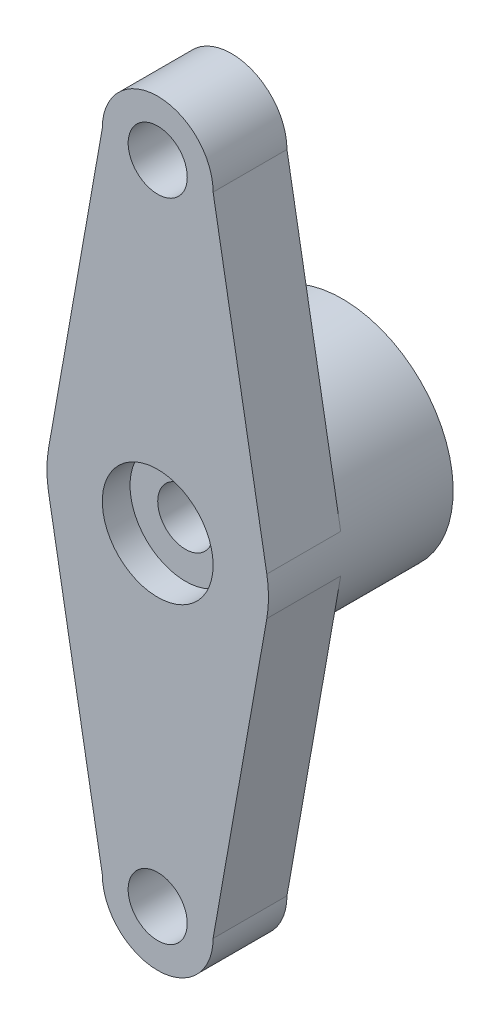
ISO-10303-21;
HEADER;
FILE_DESCRIPTION(('STEP AP214'),'2;1');
FILE_NAME('part.step','',(''),(''),'','','');
FILE_SCHEMA(('AUTOMOTIVE_DESIGN { 1 0 10303 214 1 1 1 1 }'));
ENDSEC;
DATA;
#1=APPLICATION_CONTEXT('core data for automotive mechanical design processes');
#2=APPLICATION_PROTOCOL_DEFINITION('international standard','automotive_design',2000,#1);
#3=PRODUCT_CONTEXT('',#1,'mechanical');
#4=PRODUCT('Part','Part','',(#3));
#5=PRODUCT_RELATED_PRODUCT_CATEGORY('part','',(#4));
#6=PRODUCT_DEFINITION_FORMATION('','',#4);
#7=PRODUCT_DEFINITION_CONTEXT('part definition',#1,'design');
#8=PRODUCT_DEFINITION('design','',#6,#7);
#9=PRODUCT_DEFINITION_SHAPE('','',#8);
#10=(LENGTH_UNIT() NAMED_UNIT(*) SI_UNIT(.MILLI.,.METRE.));
#11=(NAMED_UNIT(*) PLANE_ANGLE_UNIT() SI_UNIT($,.RADIAN.));
#12=(NAMED_UNIT(*) SI_UNIT($,.STERADIAN.) SOLID_ANGLE_UNIT());
#13=UNCERTAINTY_MEASURE_WITH_UNIT(LENGTH_MEASURE(1.E-05),#10,'distance_accuracy_value','');
#14=(GEOMETRIC_REPRESENTATION_CONTEXT(3) GLOBAL_UNCERTAINTY_ASSIGNED_CONTEXT((#13)) GLOBAL_UNIT_ASSIGNED_CONTEXT((#10,
#11,#12)) REPRESENTATION_CONTEXT('',''));
#15=CARTESIAN_POINT('',(0.,0.,0.));
#16=DIRECTION('',(0.,0.,1.));
#17=DIRECTION('',(1.,0.,0.));
#18=AXIS2_PLACEMENT_3D('',#15,#16,#17);
#19=CARTESIAN_POINT('',(0.,0.,0.));
#20=DIRECTION('',(0.,0.,-1.));
#21=DIRECTION('',(-1.,0.,0.));
#22=AXIS2_PLACEMENT_3D('',#19,#20,#21);
#23=CYLINDRICAL_SURFACE('',#22,1.5);
#24=CARTESIAN_POINT('',(0.,0.,-5.));
#25=DIRECTION('',(0.,0.,-1.));
#26=DIRECTION('',(-1.,0.,0.));
#27=AXIS2_PLACEMENT_3D('',#24,#25,#26);
#28=CIRCLE('',#27,1.5);
#29=CARTESIAN_POINT('',(-1.5,0.,-5.));
#30=VERTEX_POINT('',#29);
#31=EDGE_CURVE('E216',#30,#30,#28,.T.);
#32=ORIENTED_EDGE('',*,*,#31,.T.);
#33=EDGE_LOOP('',(#32));
#34=FACE_BOUND('',#33,.T.);
#35=CARTESIAN_POINT('',(0.,0.,-1.5));
#36=DIRECTION('',(0.,0.,1.));
#37=DIRECTION('',(1.,0.,0.));
#38=AXIS2_PLACEMENT_3D('',#35,#36,#37);
#39=CIRCLE('',#38,1.5);
#40=CARTESIAN_POINT('',(1.5,0.,-1.5));
#41=VERTEX_POINT('',#40);
#42=EDGE_CURVE('E43',#41,#41,#39,.F.);
#43=ORIENTED_EDGE('',*,*,#42,.F.);
#44=EDGE_LOOP('',(#43));
#45=FACE_BOUND('',#44,.T.);
#46=ADVANCED_FACE('F39',(#34,#45),#23,.F.);
#47=CARTESIAN_POINT('',(0.,17.5,-4.));
#48=DIRECTION('',(0.,0.,1.));
#49=DIRECTION('',(1.,0.,0.));
#50=AXIS2_PLACEMENT_3D('',#47,#48,#49);
#51=PLANE('',#50);
#52=CARTESIAN_POINT('',(0.,17.5,-4.));
#53=DIRECTION('',(0.,0.,1.));
#54=DIRECTION('',(1.,0.,0.));
#55=AXIS2_PLACEMENT_3D('',#52,#53,#54);
#56=CIRCLE('',#55,1.6);
#57=CARTESIAN_POINT('',(1.6,17.5,-4.));
#58=VERTEX_POINT('',#57);
#59=EDGE_CURVE('E223',#58,#58,#56,.T.);
#60=ORIENTED_EDGE('',*,*,#59,.T.);
#61=EDGE_LOOP('',(#60));
#62=FACE_BOUND('',#61,.T.);
#63=CARTESIAN_POINT('',(0.,0.,-4.));
#64=DIRECTION('',(0.,0.,-1.));
#65=DIRECTION('',(-1.,0.,0.));
#66=AXIS2_PLACEMENT_3D('',#63,#64,#65);
#67=CIRCLE('',#66,6.);
#68=CARTESIAN_POINT('',(-5.90842623804023,1.04426978776453,-4.));
#69=VERTEX_POINT('',#68);
#70=CARTESIAN_POINT('',(5.90842623804023,1.04426978776453,-4.));
#71=VERTEX_POINT('',#70);
#72=EDGE_CURVE('E52',#69,#71,#67,.T.);
#73=ORIENTED_EDGE('',*,*,#72,.F.);
#74=DIRECTION('',(-0.174044964627422,-0.984737706340038,0.));
#75=VECTOR('',#74,1.);
#76=CARTESIAN_POINT('',(-3.,17.5,-4.));
#77=LINE('',#76,#75);
#78=CARTESIAN_POINT('',(-3.,17.5,-4.));
#79=VERTEX_POINT('',#78);
#80=EDGE_CURVE('E138',#79,#69,#77,.T.);
#81=ORIENTED_EDGE('',*,*,#80,.F.);
#82=CARTESIAN_POINT('',(0.,17.5,-4.));
#83=DIRECTION('',(0.,0.,1.));
#84=DIRECTION('',(1.,0.,0.));
#85=AXIS2_PLACEMENT_3D('',#82,#83,#84);
#86=CIRCLE('',#85,3.);
#87=CARTESIAN_POINT('',(3.,17.5,-4.));
#88=VERTEX_POINT('',#87);
#89=EDGE_CURVE('E141',#88,#79,#86,.T.);
#90=ORIENTED_EDGE('',*,*,#89,.F.);
#91=DIRECTION('',(-0.174044964627422,0.984737706340038,0.));
#92=VECTOR('',#91,1.);
#93=CARTESIAN_POINT('',(3.,17.5,-4.));
#94=LINE('',#93,#92);
#95=EDGE_CURVE('E147',#71,#88,#94,.T.);
#96=ORIENTED_EDGE('',*,*,#95,.F.);
#97=EDGE_LOOP('',(#73,#81,#90,#96));
#98=FACE_BOUND('',#97,.T.);
#99=ADVANCED_FACE('F204',(#62,#98),#51,.F.);
#100=CARTESIAN_POINT('',(0.,-17.5,-4.));
#101=DIRECTION('',(0.,0.,1.));
#102=DIRECTION('',(1.,0.,0.));
#103=AXIS2_PLACEMENT_3D('',#100,#101,#102);
#104=CIRCLE('',#103,1.6);
#105=CARTESIAN_POINT('',(1.6,-17.5,-4.));
#106=VERTEX_POINT('',#105);
#107=EDGE_CURVE('E227',#106,#106,#104,.T.);
#108=ORIENTED_EDGE('',*,*,#107,.T.);
#109=EDGE_LOOP('',(#108));
#110=FACE_BOUND('',#109,.T.);
#111=CARTESIAN_POINT('',(5.90842623804023,-1.04426978776453,-4.));
#112=VERTEX_POINT('',#111);
#113=CARTESIAN_POINT('',(-5.90842623804023,-1.04426978776453,-4.));
#114=VERTEX_POINT('',#113);
#115=EDGE_CURVE('E11',#112,#114,#67,.T.);
#116=ORIENTED_EDGE('',*,*,#115,.F.);
#117=DIRECTION('',(0.174044964627422,0.984737706340038,0.));
#118=VECTOR('',#117,1.);
#119=CARTESIAN_POINT('',(3.,-17.5,-4.));
#120=LINE('',#119,#118);
#121=CARTESIAN_POINT('',(3.,-17.5,-4.));
#122=VERTEX_POINT('',#121);
#123=EDGE_CURVE('E132',#122,#112,#120,.T.);
#124=ORIENTED_EDGE('',*,*,#123,.F.);
#125=CARTESIAN_POINT('',(0.,-17.5,-4.));
#126=DIRECTION('',(0.,0.,1.));
#127=DIRECTION('',(1.,0.,0.));
#128=AXIS2_PLACEMENT_3D('',#125,#126,#127);
#129=CIRCLE('',#128,3.);
#130=CARTESIAN_POINT('',(-3.,-17.5,-4.));
#131=VERTEX_POINT('',#130);
#132=EDGE_CURVE('E114',#131,#122,#129,.T.);
#133=ORIENTED_EDGE('',*,*,#132,.F.);
#134=DIRECTION('',(0.174044964627422,-0.984737706340038,0.));
#135=VECTOR('',#134,1.);
#136=CARTESIAN_POINT('',(-5.90842623804023,-1.04426978776453,-4.));
#137=LINE('',#136,#135);
#138=EDGE_CURVE('E130',#114,#131,#137,.T.);
#139=ORIENTED_EDGE('',*,*,#138,.F.);
#140=EDGE_LOOP('',(#116,#124,#133,#139));
#141=FACE_BOUND('',#140,.T.);
#142=ADVANCED_FACE('F129',(#110,#141),#51,.F.);
#143=CARTESIAN_POINT('',(0.,17.5,-4.));
#144=DIRECTION('',(0.,0.,1.));
#145=DIRECTION('',(1.,0.,0.));
#146=AXIS2_PLACEMENT_3D('',#143,#144,#145);
#147=CYLINDRICAL_SURFACE('',#146,3.);
#148=CARTESIAN_POINT('',(0.,17.5,0.));
#149=DIRECTION('',(0.,0.,1.));
#150=DIRECTION('',(1.,0.,0.));
#151=AXIS2_PLACEMENT_3D('',#148,#149,#150);
#152=CIRCLE('',#151,3.);
#153=CARTESIAN_POINT('',(3.,17.5,0.));
#154=VERTEX_POINT('',#153);
#155=CARTESIAN_POINT('',(-3.,17.5,0.));
#156=VERTEX_POINT('',#155);
#157=EDGE_CURVE('E150',#154,#156,#152,.T.);
#158=ORIENTED_EDGE('',*,*,#157,.F.);
#159=DIRECTION('',(0.,0.,1.));
#160=VECTOR('',#159,1.);
#161=CARTESIAN_POINT('',(3.,17.5,-4.));
#162=LINE('',#161,#160);
#163=EDGE_CURVE('E50',#88,#154,#162,.T.);
#164=ORIENTED_EDGE('',*,*,#163,.F.);
#165=ORIENTED_EDGE('',*,*,#89,.T.);
#166=DIRECTION('',(0.,0.,1.));
#167=VECTOR('',#166,1.);
#168=CARTESIAN_POINT('',(-3.,17.5,-4.));
#169=LINE('',#168,#167);
#170=EDGE_CURVE('E102',#79,#156,#169,.T.);
#171=ORIENTED_EDGE('',*,*,#170,.T.);
#172=EDGE_LOOP('',(#158,#164,#165,#171));
#173=FACE_BOUND('',#172,.T.);
#174=ADVANCED_FACE('F41',(#173),#147,.T.);
#175=CARTESIAN_POINT('',(3.,17.5,-4.));
#176=DIRECTION('',(0.984737706340038,0.174044964627422,0.));
#177=DIRECTION('',(-0.174044964627422,0.984737706340038,0.));
#178=AXIS2_PLACEMENT_3D('',#175,#176,#177);
#179=PLANE('',#178);
#180=DIRECTION('',(-0.174044964627422,0.984737706340038,0.));
#181=VECTOR('',#180,1.);
#182=CARTESIAN_POINT('',(3.,17.5,0.));
#183=LINE('',#182,#181);
#184=CARTESIAN_POINT('',(5.90842623804023,1.04426978776453,0.));
#185=VERTEX_POINT('',#184);
#186=EDGE_CURVE('E175',#185,#154,#183,.T.);
#187=ORIENTED_EDGE('',*,*,#186,.F.);
#188=DIRECTION('',(0.,0.,1.));
#189=VECTOR('',#188,1.);
#190=CARTESIAN_POINT('',(5.90842623804023,1.04426978776453,-4.));
#191=LINE('',#190,#189);
#192=EDGE_CURVE('E90',#71,#185,#191,.T.);
#193=ORIENTED_EDGE('',*,*,#192,.F.);
#194=ORIENTED_EDGE('',*,*,#95,.T.);
#195=ORIENTED_EDGE('',*,*,#163,.T.);
#196=EDGE_LOOP('',(#187,#193,#194,#195));
#197=FACE_BOUND('',#196,.T.);
#198=ADVANCED_FACE('F198',(#197),#179,.T.);
#199=CARTESIAN_POINT('',(0.,0.,-4.));
#200=DIRECTION('',(0.,0.,1.));
#201=DIRECTION('',(1.,0.,0.));
#202=AXIS2_PLACEMENT_3D('',#199,#200,#201);
#203=CYLINDRICAL_SURFACE('',#202,6.);
#204=CARTESIAN_POINT('',(0.,0.,0.));
#205=DIRECTION('',(0.,0.,1.));
#206=DIRECTION('',(1.,0.,0.));
#207=AXIS2_PLACEMENT_3D('',#204,#205,#206);
#208=CIRCLE('',#207,6.);
#209=CARTESIAN_POINT('',(5.90842623804023,-1.04426978776453,0.));
#210=VERTEX_POINT('',#209);
#211=EDGE_CURVE('E172',#210,#185,#208,.T.);
#212=ORIENTED_EDGE('',*,*,#211,.F.);
#213=DIRECTION('',(0.,0.,1.));
#214=VECTOR('',#213,1.);
#215=CARTESIAN_POINT('',(5.90842623804023,-1.04426978776453,-4.));
#216=LINE('',#215,#214);
#217=EDGE_CURVE('E183',#112,#210,#216,.T.);
#218=ORIENTED_EDGE('',*,*,#217,.F.);
#219=ORIENTED_EDGE('',*,*,#115,.T.);
#220=DIRECTION('',(0.,0.,1.));
#221=VECTOR('',#220,1.);
#222=CARTESIAN_POINT('',(-5.90842623804023,-1.04426978776453,-4.));
#223=LINE('',#222,#221);
#224=CARTESIAN_POINT('',(-5.90842623804023,-1.04426978776453,0.));
#225=VERTEX_POINT('',#224);
#226=EDGE_CURVE('E123',#114,#225,#223,.T.);
#227=ORIENTED_EDGE('',*,*,#226,.T.);
#228=CARTESIAN_POINT('',(0.,0.,0.));
#229=DIRECTION('',(0.,0.,1.));
#230=DIRECTION('',(1.,0.,0.));
#231=AXIS2_PLACEMENT_3D('',#228,#229,#230);
#232=CIRCLE('',#231,6.);
#233=CARTESIAN_POINT('',(-5.90842623804023,1.04426978776453,0.));
#234=VERTEX_POINT('',#233);
#235=EDGE_CURVE('E159',#234,#225,#232,.T.);
#236=ORIENTED_EDGE('',*,*,#235,.F.);
#237=DIRECTION('',(0.,0.,1.));
#238=VECTOR('',#237,1.);
#239=CARTESIAN_POINT('',(-5.90842623804023,1.04426978776453,-4.));
#240=LINE('',#239,#238);
#241=EDGE_CURVE('E190',#69,#234,#240,.T.);
#242=ORIENTED_EDGE('',*,*,#241,.F.);
#243=ORIENTED_EDGE('',*,*,#72,.T.);
#244=ORIENTED_EDGE('',*,*,#192,.T.);
#245=EDGE_LOOP('',(#212,#218,#219,#227,#236,#242,#243,#244));
#246=FACE_BOUND('',#245,.T.);
#247=CARTESIAN_POINT('',(0.,0.,-10.));
#248=DIRECTION('',(0.,0.,-1.));
#249=DIRECTION('',(-1.,0.,0.));
#250=AXIS2_PLACEMENT_3D('',#247,#248,#249);
#251=CIRCLE('',#250,6.);
#252=CARTESIAN_POINT('',(-6.,0.,-10.));
#253=VERTEX_POINT('',#252);
#254=EDGE_CURVE('E155',#253,#253,#251,.T.);
#255=ORIENTED_EDGE('',*,*,#254,.F.);
#256=EDGE_LOOP('',(#255));
#257=FACE_BOUND('',#256,.T.);
#258=ADVANCED_FACE('F283',(#246,#257),#203,.T.);
#259=CARTESIAN_POINT('',(3.,-17.5,-4.));
#260=DIRECTION('',(0.984737706340038,-0.174044964627422,0.));
#261=DIRECTION('',(0.174044964627422,0.984737706340038,0.));
#262=AXIS2_PLACEMENT_3D('',#259,#260,#261);
#263=PLANE('',#262);
#264=DIRECTION('',(0.174044964627422,0.984737706340038,0.));
#265=VECTOR('',#264,1.);
#266=CARTESIAN_POINT('',(3.,-17.5,0.));
#267=LINE('',#266,#265);
#268=CARTESIAN_POINT('',(3.,-17.5,0.));
#269=VERTEX_POINT('',#268);
#270=EDGE_CURVE('E168',#269,#210,#267,.T.);
#271=ORIENTED_EDGE('',*,*,#270,.F.);
#272=DIRECTION('',(0.,0.,1.));
#273=VECTOR('',#272,1.);
#274=CARTESIAN_POINT('',(3.,-17.5,-4.));
#275=LINE('',#274,#273);
#276=EDGE_CURVE('E122',#122,#269,#275,.T.);
#277=ORIENTED_EDGE('',*,*,#276,.F.);
#278=ORIENTED_EDGE('',*,*,#123,.T.);
#279=ORIENTED_EDGE('',*,*,#217,.T.);
#280=EDGE_LOOP('',(#271,#277,#278,#279));
#281=FACE_BOUND('',#280,.T.);
#282=ADVANCED_FACE('F286',(#281),#263,.T.);
#283=CARTESIAN_POINT('',(0.,-17.5,-4.));
#284=DIRECTION('',(0.,0.,1.));
#285=DIRECTION('',(1.,0.,0.));
#286=AXIS2_PLACEMENT_3D('',#283,#284,#285);
#287=CYLINDRICAL_SURFACE('',#286,3.);
#288=CARTESIAN_POINT('',(0.,-17.5,0.));
#289=DIRECTION('',(0.,0.,1.));
#290=DIRECTION('',(1.,0.,0.));
#291=AXIS2_PLACEMENT_3D('',#288,#289,#290);
#292=CIRCLE('',#291,3.);
#293=CARTESIAN_POINT('',(-3.,-17.5,0.));
#294=VERTEX_POINT('',#293);
#295=EDGE_CURVE('E116',#294,#269,#292,.T.);
#296=ORIENTED_EDGE('',*,*,#295,.F.);
#297=DIRECTION('',(0.,0.,1.));
#298=VECTOR('',#297,1.);
#299=CARTESIAN_POINT('',(-3.,-17.5,-4.));
#300=LINE('',#299,#298);
#301=EDGE_CURVE('E111',#131,#294,#300,.T.);
#302=ORIENTED_EDGE('',*,*,#301,.F.);
#303=ORIENTED_EDGE('',*,*,#132,.T.);
#304=ORIENTED_EDGE('',*,*,#276,.T.);
#305=EDGE_LOOP('',(#296,#302,#303,#304));
#306=FACE_BOUND('',#305,.T.);
#307=ADVANCED_FACE('F113',(#306),#287,.T.);
#308=CARTESIAN_POINT('',(-5.90842623804023,-1.04426978776453,-4.));
#309=DIRECTION('',(-0.984737706340038,-0.174044964627422,0.));
#310=DIRECTION('',(0.174044964627422,-0.984737706340038,0.));
#311=AXIS2_PLACEMENT_3D('',#308,#309,#310);
#312=PLANE('',#311);
#313=DIRECTION('',(0.174044964627422,-0.984737706340038,0.));
#314=VECTOR('',#313,1.);
#315=CARTESIAN_POINT('',(-5.90842623804023,-1.04426978776453,0.));
#316=LINE('',#315,#314);
#317=EDGE_CURVE('E163',#225,#294,#316,.T.);
#318=ORIENTED_EDGE('',*,*,#317,.F.);
#319=ORIENTED_EDGE('',*,*,#226,.F.);
#320=ORIENTED_EDGE('',*,*,#138,.T.);
#321=ORIENTED_EDGE('',*,*,#301,.T.);
#322=EDGE_LOOP('',(#318,#319,#320,#321));
#323=FACE_BOUND('',#322,.T.);
#324=ADVANCED_FACE('F136',(#323),#312,.T.);
#325=CARTESIAN_POINT('',(-3.,17.5,-4.));
#326=DIRECTION('',(-0.984737706340038,0.174044964627422,0.));
#327=DIRECTION('',(-0.174044964627422,-0.984737706340038,0.));
#328=AXIS2_PLACEMENT_3D('',#325,#326,#327);
#329=PLANE('',#328);
#330=DIRECTION('',(-0.174044964627422,-0.984737706340038,0.));
#331=VECTOR('',#330,1.);
#332=CARTESIAN_POINT('',(-3.,17.5,0.));
#333=LINE('',#332,#331);
#334=EDGE_CURVE('E154',#156,#234,#333,.T.);
#335=ORIENTED_EDGE('',*,*,#334,.F.);
#336=ORIENTED_EDGE('',*,*,#170,.F.);
#337=ORIENTED_EDGE('',*,*,#80,.T.);
#338=ORIENTED_EDGE('',*,*,#241,.T.);
#339=EDGE_LOOP('',(#335,#336,#337,#338));
#340=FACE_BOUND('',#339,.T.);
#341=ADVANCED_FACE('F193',(#340),#329,.T.);
#342=CARTESIAN_POINT('',(0.,17.5,0.));
#343=DIRECTION('',(0.,0.,1.));
#344=DIRECTION('',(1.,0.,0.));
#345=AXIS2_PLACEMENT_3D('',#342,#343,#344);
#346=PLANE('',#345);
#347=CARTESIAN_POINT('',(0.,0.,0.));
#348=DIRECTION('',(0.,0.,1.));
#349=DIRECTION('',(1.,0.,0.));
#350=AXIS2_PLACEMENT_3D('',#347,#348,#349);
#351=CIRCLE('',#350,3.);
#352=CARTESIAN_POINT('',(3.,0.,0.));
#353=VERTEX_POINT('',#352);
#354=EDGE_CURVE('E239',#353,#353,#351,.T.);
#355=ORIENTED_EDGE('',*,*,#354,.F.);
#356=EDGE_LOOP('',(#355));
#357=FACE_BOUND('',#356,.T.);
#358=CARTESIAN_POINT('',(0.,17.5,0.));
#359=DIRECTION('',(0.,0.,1.));
#360=DIRECTION('',(1.,0.,0.));
#361=AXIS2_PLACEMENT_3D('',#358,#359,#360);
#362=CIRCLE('',#361,1.6);
#363=CARTESIAN_POINT('',(1.6,17.5,0.));
#364=VERTEX_POINT('',#363);
#365=EDGE_CURVE('E231',#364,#364,#362,.T.);
#366=ORIENTED_EDGE('',*,*,#365,.F.);
#367=EDGE_LOOP('',(#366));
#368=FACE_BOUND('',#367,.T.);
#369=CARTESIAN_POINT('',(0.,-17.5,0.));
#370=DIRECTION('',(0.,0.,1.));
#371=DIRECTION('',(1.,0.,0.));
#372=AXIS2_PLACEMENT_3D('',#369,#370,#371);
#373=CIRCLE('',#372,1.6);
#374=CARTESIAN_POINT('',(1.6,-17.5,0.));
#375=VERTEX_POINT('',#374);
#376=EDGE_CURVE('E232',#375,#375,#373,.T.);
#377=ORIENTED_EDGE('',*,*,#376,.F.);
#378=EDGE_LOOP('',(#377));
#379=FACE_BOUND('',#378,.T.);
#380=ORIENTED_EDGE('',*,*,#157,.T.);
#381=ORIENTED_EDGE('',*,*,#334,.T.);
#382=ORIENTED_EDGE('',*,*,#235,.T.);
#383=ORIENTED_EDGE('',*,*,#317,.T.);
#384=ORIENTED_EDGE('',*,*,#295,.T.);
#385=ORIENTED_EDGE('',*,*,#270,.T.);
#386=ORIENTED_EDGE('',*,*,#211,.T.);
#387=ORIENTED_EDGE('',*,*,#186,.T.);
#388=EDGE_LOOP('',(#380,#381,#382,#383,#384,#385,#386,#387));
#389=FACE_BOUND('',#388,.T.);
#390=ADVANCED_FACE('F197',(#357,#368,#379,#389),#346,.T.);
#391=CARTESIAN_POINT('',(0.,0.,-10.));
#392=DIRECTION('',(0.,0.,-1.));
#393=DIRECTION('',(-1.,0.,0.));
#394=AXIS2_PLACEMENT_3D('',#391,#392,#393);
#395=PLANE('',#394);
#396=CARTESIAN_POINT('',(0.,0.,-10.));
#397=DIRECTION('',(0.,0.,-1.));
#398=DIRECTION('',(-1.,0.,0.));
#399=AXIS2_PLACEMENT_3D('',#396,#397,#398);
#400=CIRCLE('',#399,3.);
#401=CARTESIAN_POINT('',(-3.,0.,-10.));
#402=VERTEX_POINT('',#401);
#403=EDGE_CURVE('E212',#402,#402,#400,.T.);
#404=ORIENTED_EDGE('',*,*,#403,.F.);
#405=EDGE_LOOP('',(#404));
#406=FACE_BOUND('',#405,.T.);
#407=ORIENTED_EDGE('',*,*,#254,.T.);
#408=EDGE_LOOP('',(#407));
#409=FACE_BOUND('',#408,.T.);
#410=ADVANCED_FACE('F273',(#406,#409),#395,.T.);
#411=CARTESIAN_POINT('',(0.,0.,-5.));
#412=DIRECTION('',(0.,0.,-1.));
#413=DIRECTION('',(-1.,0.,0.));
#414=AXIS2_PLACEMENT_3D('',#411,#412,#413);
#415=CYLINDRICAL_SURFACE('',#414,3.);
#416=CARTESIAN_POINT('',(0.,0.,-5.));
#417=DIRECTION('',(0.,0.,-1.));
#418=DIRECTION('',(-1.,0.,0.));
#419=AXIS2_PLACEMENT_3D('',#416,#417,#418);
#420=CIRCLE('',#419,3.);
#421=CARTESIAN_POINT('',(-3.,0.,-5.));
#422=VERTEX_POINT('',#421);
#423=EDGE_CURVE('E208',#422,#422,#420,.T.);
#424=ORIENTED_EDGE('',*,*,#423,.F.);
#425=EDGE_LOOP('',(#424));
#426=FACE_BOUND('',#425,.T.);
#427=ORIENTED_EDGE('',*,*,#403,.T.);
#428=EDGE_LOOP('',(#427));
#429=FACE_BOUND('',#428,.T.);
#430=ADVANCED_FACE('F269',(#426,#429),#415,.F.);
#431=CARTESIAN_POINT('',(0.,0.,-5.));
#432=DIRECTION('',(0.,0.,-1.));
#433=DIRECTION('',(-1.,0.,0.));
#434=AXIS2_PLACEMENT_3D('',#431,#432,#433);
#435=PLANE('',#434);
#436=ORIENTED_EDGE('',*,*,#31,.F.);
#437=EDGE_LOOP('',(#436));
#438=FACE_BOUND('',#437,.T.);
#439=ORIENTED_EDGE('',*,*,#423,.T.);
#440=EDGE_LOOP('',(#439));
#441=FACE_BOUND('',#440,.T.);
#442=ADVANCED_FACE('F266',(#438,#441),#435,.T.);
#443=CARTESIAN_POINT('',(0.,-17.5,-10.));
#444=DIRECTION('',(0.,0.,1.));
#445=DIRECTION('',(1.,0.,0.));
#446=AXIS2_PLACEMENT_3D('',#443,#444,#445);
#447=CYLINDRICAL_SURFACE('',#446,1.6);
#448=ORIENTED_EDGE('',*,*,#376,.T.);
#449=EDGE_LOOP('',(#448));
#450=FACE_BOUND('',#449,.T.);
#451=ORIENTED_EDGE('',*,*,#107,.F.);
#452=EDGE_LOOP('',(#451));
#453=FACE_BOUND('',#452,.T.);
#454=ADVANCED_FACE('F264',(#450,#453),#447,.F.);
#455=CARTESIAN_POINT('',(0.,17.5,-10.));
#456=DIRECTION('',(0.,0.,1.));
#457=DIRECTION('',(1.,0.,0.));
#458=AXIS2_PLACEMENT_3D('',#455,#456,#457);
#459=CYLINDRICAL_SURFACE('',#458,1.6);
#460=ORIENTED_EDGE('',*,*,#365,.T.);
#461=EDGE_LOOP('',(#460));
#462=FACE_BOUND('',#461,.T.);
#463=ORIENTED_EDGE('',*,*,#59,.F.);
#464=EDGE_LOOP('',(#463));
#465=FACE_BOUND('',#464,.T.);
#466=ADVANCED_FACE('F322',(#462,#465),#459,.F.);
#467=CARTESIAN_POINT('',(0.,0.,-1.5));
#468=DIRECTION('',(0.,0.,1.));
#469=DIRECTION('',(1.,0.,0.));
#470=AXIS2_PLACEMENT_3D('',#467,#468,#469);
#471=PLANE('',#470);
#472=CARTESIAN_POINT('',(0.,0.,-1.5));
#473=DIRECTION('',(0.,0.,1.));
#474=DIRECTION('',(1.,0.,0.));
#475=AXIS2_PLACEMENT_3D('',#472,#473,#474);
#476=CIRCLE('',#475,3.);
#477=CARTESIAN_POINT('',(3.,0.,-1.5));
#478=VERTEX_POINT('',#477);
#479=EDGE_CURVE('E243',#478,#478,#476,.T.);
#480=ORIENTED_EDGE('',*,*,#479,.T.);
#481=EDGE_LOOP('',(#480));
#482=FACE_BOUND('',#481,.T.);
#483=ORIENTED_EDGE('',*,*,#42,.T.);
#484=EDGE_LOOP('',(#483));
#485=FACE_BOUND('',#484,.T.);
#486=ADVANCED_FACE('F252',(#482,#485),#471,.T.);
#487=CARTESIAN_POINT('',(0.,0.,-1.5));
#488=DIRECTION('',(0.,0.,1.));
#489=DIRECTION('',(1.,0.,0.));
#490=AXIS2_PLACEMENT_3D('',#487,#488,#489);
#491=CYLINDRICAL_SURFACE('',#490,3.);
#492=ORIENTED_EDGE('',*,*,#479,.F.);
#493=EDGE_LOOP('',(#492));
#494=FACE_BOUND('',#493,.T.);
#495=ORIENTED_EDGE('',*,*,#354,.T.);
#496=EDGE_LOOP('',(#495));
#497=FACE_BOUND('',#496,.T.);
#498=ADVANCED_FACE('F335',(#494,#497),#491,.F.);
#499=CLOSED_SHELL('',(#46,#99,#142,#174,#198,#258,#282,#307,#324,#341,#390,#410,#430,#442,#454,
#466,#486,#498));
#500=MANIFOLD_SOLID_BREP('B2',#499);
#501=ADVANCED_BREP_SHAPE_REPRESENTATION('',(#18,#500),#14);
#502=SHAPE_DEFINITION_REPRESENTATION(#9,#501);
ENDSEC;
END-ISO-10303-21;
